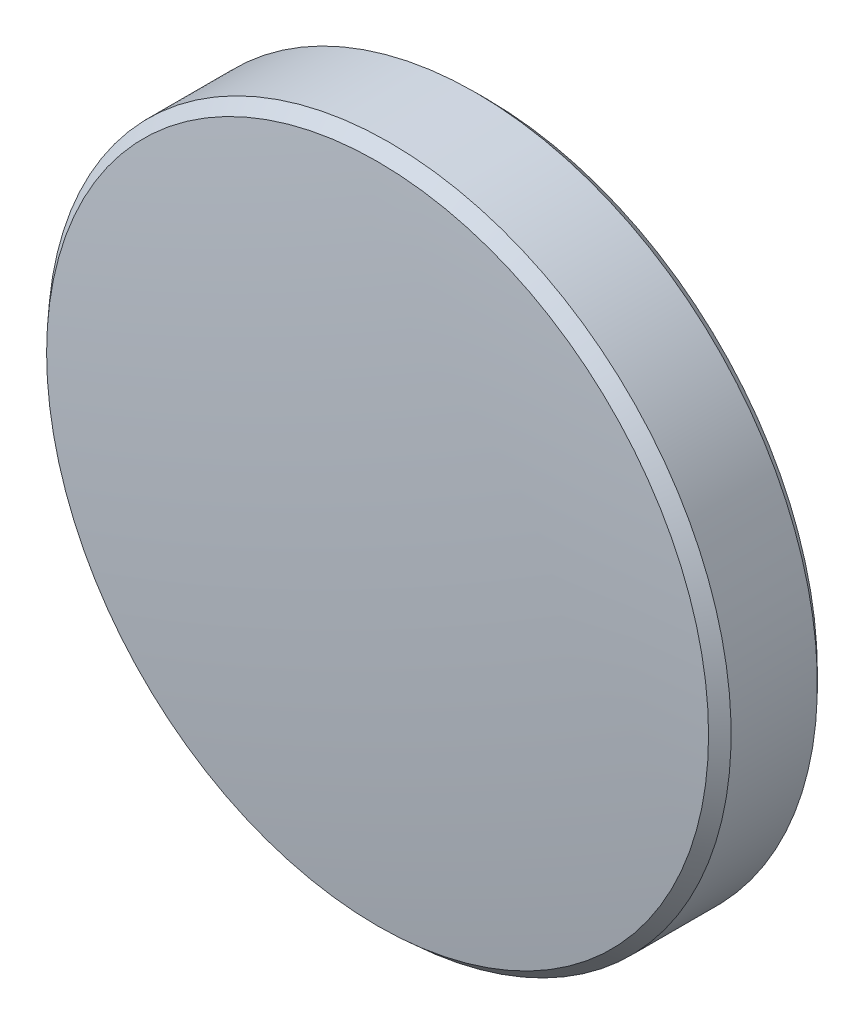
ISO-10303-21;
HEADER;
FILE_DESCRIPTION(('STEP AP214'),'2;1');
FILE_NAME('part.step','',(''),(''),'','','');
FILE_SCHEMA(('AUTOMOTIVE_DESIGN { 1 0 10303 214 1 1 1 1 }'));
ENDSEC;
DATA;
#1=APPLICATION_CONTEXT('core data for automotive mechanical design processes');
#2=APPLICATION_PROTOCOL_DEFINITION('international standard','automotive_design',2000,#1);
#3=PRODUCT_CONTEXT('',#1,'mechanical');
#4=PRODUCT('Part','Part','',(#3));
#5=PRODUCT_RELATED_PRODUCT_CATEGORY('part','',(#4));
#6=PRODUCT_DEFINITION_FORMATION('','',#4);
#7=PRODUCT_DEFINITION_CONTEXT('part definition',#1,'design');
#8=PRODUCT_DEFINITION('design','',#6,#7);
#9=PRODUCT_DEFINITION_SHAPE('','',#8);
#10=(LENGTH_UNIT() NAMED_UNIT(*) SI_UNIT(.MILLI.,.METRE.));
#11=(NAMED_UNIT(*) PLANE_ANGLE_UNIT() SI_UNIT($,.RADIAN.));
#12=(NAMED_UNIT(*) SI_UNIT($,.STERADIAN.) SOLID_ANGLE_UNIT());
#13=UNCERTAINTY_MEASURE_WITH_UNIT(LENGTH_MEASURE(1.E-05),#10,'distance_accuracy_value','');
#14=(GEOMETRIC_REPRESENTATION_CONTEXT(3) GLOBAL_UNCERTAINTY_ASSIGNED_CONTEXT((#13)) GLOBAL_UNIT_ASSIGNED_CONTEXT((#10,
#11,#12)) REPRESENTATION_CONTEXT('',''));
#15=CARTESIAN_POINT('',(0.,0.,0.));
#16=DIRECTION('',(0.,0.,1.));
#17=DIRECTION('',(1.,0.,0.));
#18=AXIS2_PLACEMENT_3D('',#15,#16,#17);
#19=CARTESIAN_POINT('',(0.,0.,-1.17));
#20=DIRECTION('',(0.,0.,-1.));
#21=DIRECTION('',(0.,1.,0.));
#22=AXIS2_PLACEMENT_3D('',#19,#20,#21);
#23=PLANE('',#22);
#24=CARTESIAN_POINT('',(0.,0.,-1.17));
#25=DIRECTION('',(0.,0.,-1.));
#26=DIRECTION('',(0.,1.,0.));
#27=AXIS2_PLACEMENT_3D('',#24,#25,#26);
#28=CIRCLE('',#27,6.15);
#29=CARTESIAN_POINT('',(0.,6.15,-1.17));
#30=VERTEX_POINT('',#29);
#31=EDGE_CURVE('E28',#30,#30,#28,.T.);
#32=ORIENTED_EDGE('',*,*,#31,.T.);
#33=EDGE_LOOP('',(#32));
#34=FACE_BOUND('',#33,.T.);
#35=ADVANCED_FACE('F13',(#34),#23,.T.);
#36=CARTESIAN_POINT('',(0.,0.,-58.9079999999997));
#37=DIRECTION('',(0.,0.,-1.));
#38=DIRECTION('',(0.,1.,0.));
#39=AXIS2_PLACEMENT_3D('',#36,#37,#38);
#40=SPHERICAL_SURFACE('',#39,60.0779999999998);
#41=CARTESIAN_POINT('',(0.,0.,0.854243286151447));
#42=DIRECTION('',(0.,0.,-1.));
#43=DIRECTION('',(0.,1.,0.));
#44=AXIS2_PLACEMENT_3D('',#41,#42,#43);
#45=CIRCLE('',#44,6.151451975498);
#46=CARTESIAN_POINT('',(0.,6.15145197549799,0.854243286151449));
#47=VERTEX_POINT('',#46);
#48=EDGE_CURVE('E9',#47,#47,#45,.F.);
#49=ORIENTED_EDGE('',*,*,#48,.T.);
#50=EDGE_LOOP('',(#49));
#51=FACE_BOUND('',#50,.T.);
#52=ADVANCED_FACE('F45',(#51),#40,.T.);
#53=CARTESIAN_POINT('',(0.,0.,-1.17));
#54=DIRECTION('',(0.,0.,-1.));
#55=DIRECTION('',(0.,1.,0.));
#56=AXIS2_PLACEMENT_3D('',#53,#54,#55);
#57=CYLINDRICAL_SURFACE('',#56,6.34999999999999);
#58=CARTESIAN_POINT('',(0.,0.,-0.970000000000006));
#59=DIRECTION('',(0.,0.,-1.));
#60=DIRECTION('',(0.,1.,0.));
#61=AXIS2_PLACEMENT_3D('',#58,#59,#60);
#62=CIRCLE('',#61,6.34999999999999);
#63=CARTESIAN_POINT('',(0.,6.34999999999999,-0.970000000000004));
#64=VERTEX_POINT('',#63);
#65=EDGE_CURVE('E20',#64,#64,#62,.F.);
#66=ORIENTED_EDGE('',*,*,#65,.T.);
#67=EDGE_LOOP('',(#66));
#68=FACE_BOUND('',#67,.T.);
#69=CARTESIAN_POINT('',(0.,0.,0.633472897812057));
#70=DIRECTION('',(0.,0.,1.));
#71=DIRECTION('',(0.,-1.,0.));
#72=AXIS2_PLACEMENT_3D('',#69,#70,#71);
#73=CIRCLE('',#72,6.34999999999999);
#74=CARTESIAN_POINT('',(0.,-6.34999999999999,0.633472897812055));
#75=VERTEX_POINT('',#74);
#76=EDGE_CURVE('E24',#75,#75,#73,.F.);
#77=ORIENTED_EDGE('',*,*,#76,.T.);
#78=EDGE_LOOP('',(#77));
#79=FACE_BOUND('',#78,.T.);
#80=ADVANCED_FACE('F37',(#68,#79),#57,.T.);
#81=CARTESIAN_POINT('',(0.,0.,-1.17));
#82=DIRECTION('',(0.,0.,1.));
#83=DIRECTION('',(0.,-1.,0.));
#84=AXIS2_PLACEMENT_3D('',#81,#82,#83);
#85=CONICAL_SURFACE('',#84,6.15,0.78539816339745);
#86=ORIENTED_EDGE('',*,*,#65,.F.);
#87=EDGE_LOOP('',(#86));
#88=FACE_BOUND('',#87,.T.);
#89=ORIENTED_EDGE('',*,*,#31,.F.);
#90=EDGE_LOOP('',(#89));
#91=FACE_BOUND('',#90,.T.);
#92=ADVANCED_FACE('F35',(#88,#91),#85,.T.);
#93=CARTESIAN_POINT('',(0.,0.,0.633472897812057));
#94=DIRECTION('',(0.,0.,-1.));
#95=DIRECTION('',(0.,1.,0.));
#96=AXIS2_PLACEMENT_3D('',#93,#94,#95);
#97=CONICAL_SURFACE('',#96,6.34999999999999,0.732451301447072);
#98=ORIENTED_EDGE('',*,*,#48,.F.);
#99=EDGE_LOOP('',(#98));
#100=FACE_BOUND('',#99,.T.);
#101=ORIENTED_EDGE('',*,*,#76,.F.);
#102=EDGE_LOOP('',(#101));
#103=FACE_BOUND('',#102,.T.);
#104=ADVANCED_FACE('F15',(#100,#103),#97,.T.);
#105=CLOSED_SHELL('',(#35,#52,#80,#92,#104));
#106=MANIFOLD_SOLID_BREP('B1',#105);
#107=ADVANCED_BREP_SHAPE_REPRESENTATION('',(#18,#106),#14);
#108=SHAPE_DEFINITION_REPRESENTATION(#9,#107);
ENDSEC;
END-ISO-10303-21;
